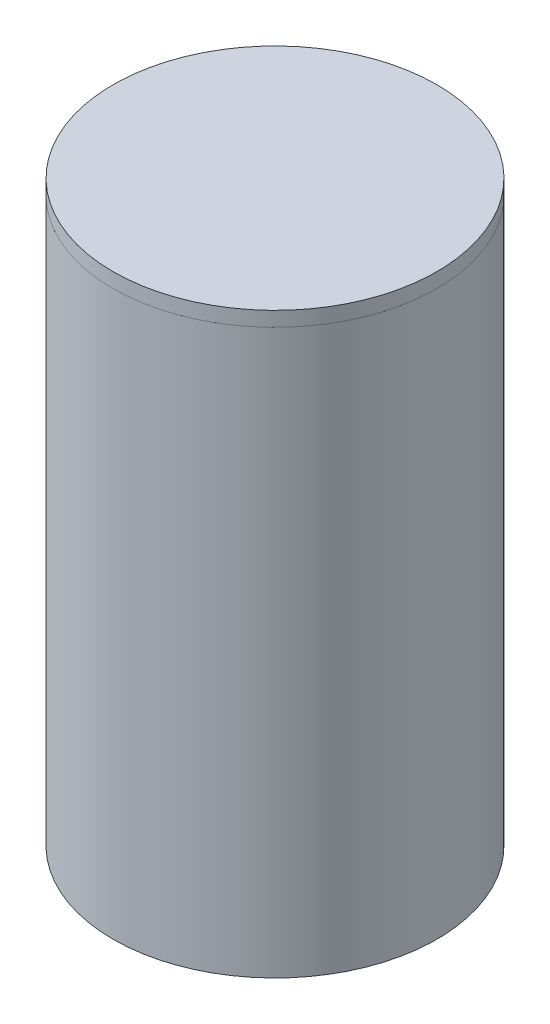
ISO-10303-21;
HEADER;
FILE_DESCRIPTION(('STEP AP214'),'2;1');
FILE_NAME('part.step','',(''),(''),'','','');
FILE_SCHEMA(('AUTOMOTIVE_DESIGN { 1 0 10303 214 1 1 1 1 }'));
ENDSEC;
DATA;
#1=APPLICATION_CONTEXT('core data for automotive mechanical design processes');
#2=APPLICATION_PROTOCOL_DEFINITION('international standard','automotive_design',2000,#1);
#3=PRODUCT_CONTEXT('',#1,'mechanical');
#4=PRODUCT('Part','Part','',(#3));
#5=PRODUCT_RELATED_PRODUCT_CATEGORY('part','',(#4));
#6=PRODUCT_DEFINITION_FORMATION('','',#4);
#7=PRODUCT_DEFINITION_CONTEXT('part definition',#1,'design');
#8=PRODUCT_DEFINITION('design','',#6,#7);
#9=PRODUCT_DEFINITION_SHAPE('','',#8);
#10=(LENGTH_UNIT() NAMED_UNIT(*) SI_UNIT(.MILLI.,.METRE.));
#11=(NAMED_UNIT(*) PLANE_ANGLE_UNIT() SI_UNIT($,.RADIAN.));
#12=(NAMED_UNIT(*) SI_UNIT($,.STERADIAN.) SOLID_ANGLE_UNIT());
#13=UNCERTAINTY_MEASURE_WITH_UNIT(LENGTH_MEASURE(1.E-05),#10,'distance_accuracy_value','');
#14=(GEOMETRIC_REPRESENTATION_CONTEXT(3) GLOBAL_UNCERTAINTY_ASSIGNED_CONTEXT((#13)) GLOBAL_UNIT_ASSIGNED_CONTEXT((#10,
#11,#12)) REPRESENTATION_CONTEXT('',''));
#15=CARTESIAN_POINT('',(0.,0.,0.));
#16=DIRECTION('',(0.,0.,1.));
#17=DIRECTION('',(1.,0.,0.));
#18=AXIS2_PLACEMENT_3D('',#15,#16,#17);
#19=CARTESIAN_POINT('',(35.9691205255295,121.976773001691,89.2429440919188));
#20=DIRECTION('',(0.,1.,0.));
#21=DIRECTION('',(-0.627321769395788,0.,-0.778760166959083));
#22=AXIS2_PLACEMENT_3D('',#19,#20,#21);
#23=CYLINDRICAL_SURFACE('',#22,33.1);
#24=CARTESIAN_POINT('',(35.9691205255295,121.976773001691,89.2429440919188));
#25=DIRECTION('',(0.,-1.,0.));
#26=DIRECTION('',(0.627321769395788,0.,0.778760166959083));
#27=AXIS2_PLACEMENT_3D('',#24,#25,#26);
#28=CIRCLE('',#27,33.1);
#29=CARTESIAN_POINT('',(56.7334710925301,121.976773001691,115.019905618264));
#30=VERTEX_POINT('',#29);
#31=EDGE_CURVE('P0_E21',#30,#30,#28,.T.);
#32=ORIENTED_EDGE('',*,*,#31,.F.);
#33=EDGE_LOOP('',(#32));
#34=FACE_BOUND('',#33,.T.);
#35=CARTESIAN_POINT('',(35.9691205255295,124.976773001691,89.2429440919188));
#36=DIRECTION('',(0.,-1.,0.));
#37=DIRECTION('',(0.627321769395788,0.,0.778760166959083));
#38=AXIS2_PLACEMENT_3D('',#35,#36,#37);
#39=CIRCLE('',#38,33.1);
#40=CARTESIAN_POINT('',(56.7334710925301,124.976773001691,115.019905618264));
#41=VERTEX_POINT('',#40);
#42=EDGE_CURVE('P0_E17',#41,#41,#39,.T.);
#43=ORIENTED_EDGE('',*,*,#42,.T.);
#44=EDGE_LOOP('',(#43));
#45=FACE_BOUND('',#44,.T.);
#46=ADVANCED_FACE('P0_F14',(#34,#45),#23,.T.);
#47=CARTESIAN_POINT('',(35.9691205255295,121.976773001691,89.2429440919188));
#48=DIRECTION('',(0.,-1.,0.));
#49=DIRECTION('',(0.627321769395788,0.,0.778760166959083));
#50=AXIS2_PLACEMENT_3D('',#47,#48,#49);
#51=PLANE('',#50);
#52=CARTESIAN_POINT('',(35.9691205255295,121.976773001691,89.2429440919188));
#53=DIRECTION('',(0.,-1.,0.));
#54=DIRECTION('',(0.627321769395788,0.,0.778760166959083));
#55=AXIS2_PLACEMENT_3D('',#52,#53,#54);
#56=CIRCLE('',#55,30.4);
#57=CARTESIAN_POINT('',(55.0397023151615,121.976773001691,112.917253167475));
#58=VERTEX_POINT('',#57);
#59=EDGE_CURVE('P0_E9',#58,#58,#56,.T.);
#60=ORIENTED_EDGE('',*,*,#59,.F.);
#61=EDGE_LOOP('',(#60));
#62=FACE_BOUND('',#61,.T.);
#63=ORIENTED_EDGE('',*,*,#31,.T.);
#64=EDGE_LOOP('',(#63));
#65=FACE_BOUND('',#64,.T.);
#66=ADVANCED_FACE('P0_F38',(#62,#65),#51,.T.);
#67=CARTESIAN_POINT('',(35.9691205255295,124.976773001691,89.2429440919188));
#68=DIRECTION('',(0.,-1.,0.));
#69=DIRECTION('',(0.627321769395788,0.,0.778760166959083));
#70=AXIS2_PLACEMENT_3D('',#67,#68,#69);
#71=PLANE('',#70);
#72=ORIENTED_EDGE('',*,*,#42,.F.);
#73=EDGE_LOOP('',(#72));
#74=FACE_BOUND('',#73,.T.);
#75=ADVANCED_FACE('P0_F35',(#74),#71,.F.);
#76=CARTESIAN_POINT('',(35.9691205255295,116.976773001691,89.2429440919188));
#77=DIRECTION('',(0.,1.,0.));
#78=DIRECTION('',(-0.627321769395788,0.,-0.778760166959083));
#79=AXIS2_PLACEMENT_3D('',#76,#77,#78);
#80=CYLINDRICAL_SURFACE('',#79,30.4);
#81=CARTESIAN_POINT('',(35.9691205255295,116.976773001691,89.2429440919188));
#82=DIRECTION('',(0.,-1.,0.));
#83=DIRECTION('',(0.627321769395788,0.,0.778760166959083));
#84=AXIS2_PLACEMENT_3D('',#81,#82,#83);
#85=CIRCLE('',#84,30.4);
#86=CARTESIAN_POINT('',(55.0397023151615,116.976773001691,112.917253167475));
#87=VERTEX_POINT('',#86);
#88=EDGE_CURVE('P0_E27',#87,#87,#85,.T.);
#89=ORIENTED_EDGE('',*,*,#88,.F.);
#90=EDGE_LOOP('',(#89));
#91=FACE_BOUND('',#90,.T.);
#92=ORIENTED_EDGE('',*,*,#59,.T.);
#93=EDGE_LOOP('',(#92));
#94=FACE_BOUND('',#93,.T.);
#95=ADVANCED_FACE('P0_F37',(#91,#94),#80,.T.);
#96=CARTESIAN_POINT('',(35.9691205255295,116.976773001691,89.2429440919188));
#97=DIRECTION('',(0.,-1.,0.));
#98=DIRECTION('',(0.627321769395788,0.,0.778760166959083));
#99=AXIS2_PLACEMENT_3D('',#96,#97,#98);
#100=PLANE('',#99);
#101=ORIENTED_EDGE('',*,*,#88,.T.);
#102=EDGE_LOOP('',(#101));
#103=FACE_BOUND('',#102,.T.);
#104=ADVANCED_FACE('P0_F44',(#103),#100,.T.);
#105=CLOSED_SHELL('',(#46,#66,#75,#95,#104));
#106=MANIFOLD_SOLID_BREP('P0_B1',#105);
#107=CARTESIAN_POINT('',(35.9691205255295,121.976773001691,89.2429440919188));
#108=DIRECTION('',(0.,-1.,0.));
#109=DIRECTION('',(0.,0.,-1.));
#110=AXIS2_PLACEMENT_3D('',#107,#108,#109);
#111=CYLINDRICAL_SURFACE('',#110,30.6);
#112=CARTESIAN_POINT('',(35.9691205255295,121.976773001691,89.2429440919188));
#113=DIRECTION('',(0.,1.,0.));
#114=DIRECTION('',(0.,0.,1.));
#115=AXIS2_PLACEMENT_3D('',#112,#113,#114);
#116=CIRCLE('',#115,30.6);
#117=CARTESIAN_POINT('',(35.9691205255295,121.976773001691,119.842944091919));
#118=VERTEX_POINT('',#117);
#119=EDGE_CURVE('P1_E31',#118,#118,#116,.T.);
#120=ORIENTED_EDGE('',*,*,#119,.T.);
#121=EDGE_LOOP('',(#120));
#122=FACE_BOUND('',#121,.T.);
#123=CARTESIAN_POINT('',(35.9691205255295,9.27677300169076,89.2429440919188));
#124=DIRECTION('',(0.,1.,0.));
#125=DIRECTION('',(0.,0.,1.));
#126=AXIS2_PLACEMENT_3D('',#123,#124,#125);
#127=CIRCLE('',#126,30.6);
#128=CARTESIAN_POINT('',(35.9691205255295,9.27677300169076,119.842944091919));
#129=VERTEX_POINT('',#128);
#130=EDGE_CURVE('P1_E10',#129,#129,#127,.T.);
#131=ORIENTED_EDGE('',*,*,#130,.F.);
#132=EDGE_LOOP('',(#131));
#133=FACE_BOUND('',#132,.T.);
#134=ADVANCED_FACE('P1_F15',(#122,#133),#111,.F.);
#135=CARTESIAN_POINT('',(35.9691205255295,9.27677300169076,89.2429440919188));
#136=DIRECTION('',(0.,1.,0.));
#137=DIRECTION('',(0.,0.,1.));
#138=AXIS2_PLACEMENT_3D('',#135,#136,#137);
#139=PLANE('',#138);
#140=ORIENTED_EDGE('',*,*,#130,.T.);
#141=EDGE_LOOP('',(#140));
#142=FACE_BOUND('',#141,.T.);
#143=ADVANCED_FACE('P1_F17',(#142),#139,.T.);
#144=CARTESIAN_POINT('',(35.9691205255295,121.976773001691,89.2429440919188));
#145=DIRECTION('',(0.,-1.,0.));
#146=DIRECTION('',(0.,0.,-1.));
#147=AXIS2_PLACEMENT_3D('',#144,#145,#146);
#148=CYLINDRICAL_SURFACE('',#147,33.1);
#149=CARTESIAN_POINT('',(35.9691205255295,121.976773001691,89.2429440919188));
#150=DIRECTION('',(0.,1.,0.));
#151=DIRECTION('',(0.,0.,1.));
#152=AXIS2_PLACEMENT_3D('',#149,#150,#151);
#153=CIRCLE('',#152,33.1);
#154=CARTESIAN_POINT('',(35.9691205255295,121.976773001691,122.342944091919));
#155=VERTEX_POINT('',#154);
#156=EDGE_CURVE('P1_E22',#155,#155,#153,.T.);
#157=ORIENTED_EDGE('',*,*,#156,.F.);
#158=EDGE_LOOP('',(#157));
#159=FACE_BOUND('',#158,.T.);
#160=CARTESIAN_POINT('',(35.9691205255295,6.77677300169076,89.2429440919188));
#161=DIRECTION('',(0.,1.,0.));
#162=DIRECTION('',(0.,0.,1.));
#163=AXIS2_PLACEMENT_3D('',#160,#161,#162);
#164=CIRCLE('',#163,33.1);
#165=CARTESIAN_POINT('',(35.9691205255295,6.77677300169076,122.342944091919));
#166=VERTEX_POINT('',#165);
#167=EDGE_CURVE('P1_E26',#166,#166,#164,.T.);
#168=ORIENTED_EDGE('',*,*,#167,.T.);
#169=EDGE_LOOP('',(#168));
#170=FACE_BOUND('',#169,.T.);
#171=ADVANCED_FACE('P1_F41',(#159,#170),#148,.T.);
#172=CARTESIAN_POINT('',(35.9691205255295,121.976773001691,89.2429440919188));
#173=DIRECTION('',(0.,1.,0.));
#174=DIRECTION('',(0.,0.,1.));
#175=AXIS2_PLACEMENT_3D('',#172,#173,#174);
#176=PLANE('',#175);
#177=ORIENTED_EDGE('',*,*,#119,.F.);
#178=EDGE_LOOP('',(#177));
#179=FACE_BOUND('',#178,.T.);
#180=ORIENTED_EDGE('',*,*,#156,.T.);
#181=EDGE_LOOP('',(#180));
#182=FACE_BOUND('',#181,.T.);
#183=ADVANCED_FACE('P1_F38',(#179,#182),#176,.T.);
#184=CARTESIAN_POINT('',(35.9691205255295,6.77677300169076,89.2429440919188));
#185=DIRECTION('',(0.,1.,0.));
#186=DIRECTION('',(0.,0.,1.));
#187=AXIS2_PLACEMENT_3D('',#184,#185,#186);
#188=PLANE('',#187);
#189=ORIENTED_EDGE('',*,*,#167,.F.);
#190=EDGE_LOOP('',(#189));
#191=FACE_BOUND('',#190,.T.);
#192=ADVANCED_FACE('P1_F40',(#191),#188,.F.);
#193=CLOSED_SHELL('',(#134,#143,#171,#183,#192));
#194=MANIFOLD_SOLID_BREP('P1_B1',#193);
#195=ADVANCED_BREP_SHAPE_REPRESENTATION('',(#18,#106,#194),#14);
#196=SHAPE_DEFINITION_REPRESENTATION(#9,#195);
ENDSEC;
END-ISO-10303-21;
